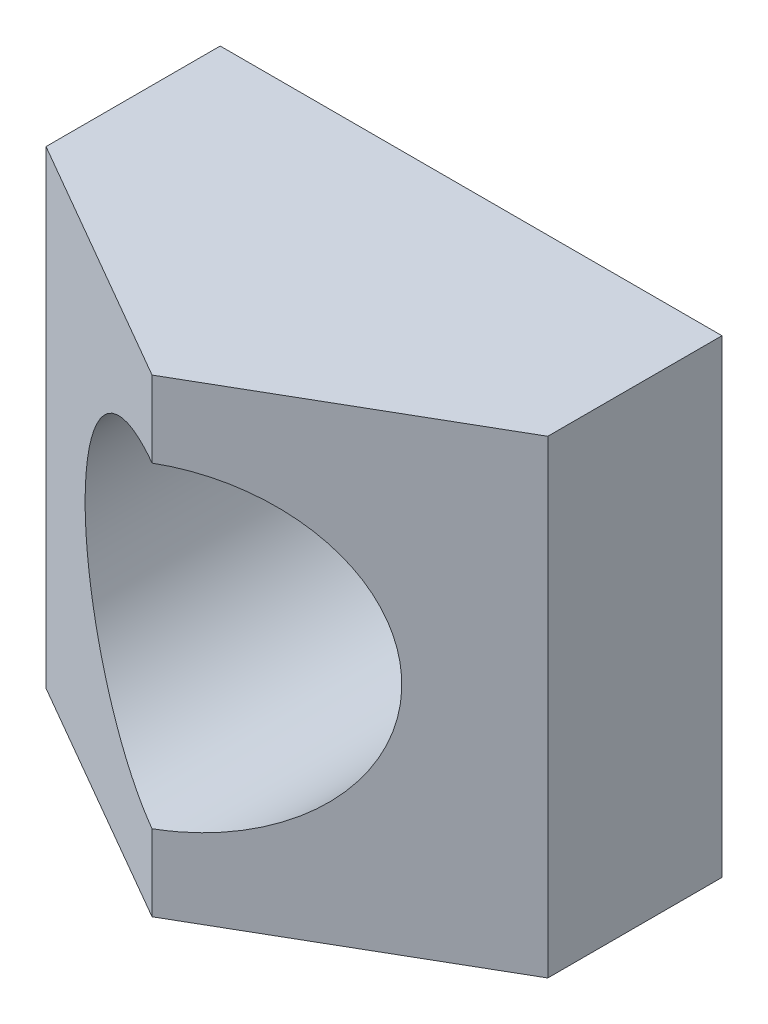
ISO-10303-21;
HEADER;
FILE_DESCRIPTION(('STEP AP214'),'2;1');
FILE_NAME('part.step','',(''),(''),'','','');
FILE_SCHEMA(('AUTOMOTIVE_DESIGN { 1 0 10303 214 1 1 1 1 }'));
ENDSEC;
DATA;
#1=APPLICATION_CONTEXT('core data for automotive mechanical design processes');
#2=APPLICATION_PROTOCOL_DEFINITION('international standard','automotive_design',2000,#1);
#3=PRODUCT_CONTEXT('',#1,'mechanical');
#4=PRODUCT('Part','Part','',(#3));
#5=PRODUCT_RELATED_PRODUCT_CATEGORY('part','',(#4));
#6=PRODUCT_DEFINITION_FORMATION('','',#4);
#7=PRODUCT_DEFINITION_CONTEXT('part definition',#1,'design');
#8=PRODUCT_DEFINITION('design','',#6,#7);
#9=PRODUCT_DEFINITION_SHAPE('','',#8);
#10=(LENGTH_UNIT() NAMED_UNIT(*) SI_UNIT(.MILLI.,.METRE.));
#11=(NAMED_UNIT(*) PLANE_ANGLE_UNIT() SI_UNIT($,.RADIAN.));
#12=(NAMED_UNIT(*) SI_UNIT($,.STERADIAN.) SOLID_ANGLE_UNIT());
#13=UNCERTAINTY_MEASURE_WITH_UNIT(LENGTH_MEASURE(1.E-05),#10,'distance_accuracy_value','');
#14=(GEOMETRIC_REPRESENTATION_CONTEXT(3) GLOBAL_UNCERTAINTY_ASSIGNED_CONTEXT((#13)) GLOBAL_UNIT_ASSIGNED_CONTEXT((#10,
#11,#12)) REPRESENTATION_CONTEXT('',''));
#15=CARTESIAN_POINT('',(0.,0.,0.));
#16=DIRECTION('',(0.,0.,1.));
#17=DIRECTION('',(1.,0.,0.));
#18=AXIS2_PLACEMENT_3D('',#15,#16,#17);
#19=CARTESIAN_POINT('',(0.,4.,4.94));
#20=DIRECTION('',(-0.5,0.,-0.866025403784439));
#21=DIRECTION('',(-0.866025403784439,0.,0.5));
#22=AXIS2_PLACEMENT_3D('',#19,#20,#21);
#23=PLANE('',#22);
#24=CARTESIAN_POINT('',(0.,0.,4.94));
#25=DIRECTION('',(-0.5,0.,-0.866025403784439));
#26=DIRECTION('',(0.866025403784439,0.,-0.5));
#27=AXIS2_PLACEMENT_3D('',#24,#25,#26);
#28=ELLIPSE('',#27,3.11769145362398,2.7);
#29=CARTESIAN_POINT('',(0.,-2.7,4.94));
#30=VERTEX_POINT('',#29);
#31=CARTESIAN_POINT('',(0.,2.7,4.94));
#32=VERTEX_POINT('',#31);
#33=EDGE_CURVE('E48',#30,#32,#28,.F.);
#34=ORIENTED_EDGE('',*,*,#33,.F.);
#35=DIRECTION('',(0.,-1.,0.));
#36=VECTOR('',#35,1.);
#37=CARTESIAN_POINT('',(0.,4.,4.94));
#38=LINE('',#37,#36);
#39=CARTESIAN_POINT('',(0.,-4.,4.94));
#40=VERTEX_POINT('',#39);
#41=EDGE_CURVE('E91',#30,#40,#38,.T.);
#42=ORIENTED_EDGE('',*,*,#41,.T.);
#43=DIRECTION('',(0.866025403784439,0.,-0.5));
#44=VECTOR('',#43,1.);
#45=CARTESIAN_POINT('',(0.,-4.,4.94));
#46=LINE('',#45,#44);
#47=CARTESIAN_POINT('',(4.27816549469512,-4.,2.47));
#48=VERTEX_POINT('',#47);
#49=EDGE_CURVE('E125',#40,#48,#46,.T.);
#50=ORIENTED_EDGE('',*,*,#49,.T.);
#51=DIRECTION('',(0.,-1.,0.));
#52=VECTOR('',#51,1.);
#53=CARTESIAN_POINT('',(4.27816549469512,4.,2.47));
#54=LINE('',#53,#52);
#55=CARTESIAN_POINT('',(4.27816549469512,4.,2.47));
#56=VERTEX_POINT('',#55);
#57=EDGE_CURVE('E112',#56,#48,#54,.T.);
#58=ORIENTED_EDGE('',*,*,#57,.F.);
#59=DIRECTION('',(0.866025403784439,0.,-0.5));
#60=VECTOR('',#59,1.);
#61=CARTESIAN_POINT('',(0.,4.,4.94));
#62=LINE('',#61,#60);
#63=CARTESIAN_POINT('',(0.,4.,4.94));
#64=VERTEX_POINT('',#63);
#65=EDGE_CURVE('E133',#64,#56,#62,.T.);
#66=ORIENTED_EDGE('',*,*,#65,.F.);
#67=EDGE_CURVE('E94',#64,#32,#38,.T.);
#68=ORIENTED_EDGE('',*,*,#67,.T.);
#69=EDGE_LOOP('',(#34,#42,#50,#58,#66,#68));
#70=FACE_BOUND('',#69,.T.);
#71=ADVANCED_FACE('F36',(#70),#23,.F.);
#72=CARTESIAN_POINT('',(-4.27816549469513,4.,2.47));
#73=DIRECTION('',(0.5,0.,-0.866025403784439));
#74=DIRECTION('',(-0.866025403784439,0.,-0.5));
#75=AXIS2_PLACEMENT_3D('',#72,#73,#74);
#76=PLANE('',#75);
#77=CARTESIAN_POINT('',(0.,0.,4.94));
#78=DIRECTION('',(0.5,0.,-0.866025403784439));
#79=DIRECTION('',(-0.866025403784439,0.,-0.5));
#80=AXIS2_PLACEMENT_3D('',#77,#78,#79);
#81=ELLIPSE('',#80,3.11769145362398,2.7);
#82=EDGE_CURVE('E12',#32,#30,#81,.F.);
#83=ORIENTED_EDGE('',*,*,#82,.F.);
#84=ORIENTED_EDGE('',*,*,#67,.F.);
#85=DIRECTION('',(0.866025403784439,0.,0.5));
#86=VECTOR('',#85,1.);
#87=CARTESIAN_POINT('',(-4.27816549469513,4.,2.47));
#88=LINE('',#87,#86);
#89=CARTESIAN_POINT('',(-4.27816549469513,4.,2.47));
#90=VERTEX_POINT('',#89);
#91=EDGE_CURVE('E103',#90,#64,#88,.T.);
#92=ORIENTED_EDGE('',*,*,#91,.F.);
#93=DIRECTION('',(0.,-1.,0.));
#94=VECTOR('',#93,1.);
#95=CARTESIAN_POINT('',(-4.27816549469513,4.,2.47));
#96=LINE('',#95,#94);
#97=CARTESIAN_POINT('',(-4.27816549469513,-4.,2.47));
#98=VERTEX_POINT('',#97);
#99=EDGE_CURVE('E105',#90,#98,#96,.T.);
#100=ORIENTED_EDGE('',*,*,#99,.T.);
#101=DIRECTION('',(0.866025403784439,0.,0.5));
#102=VECTOR('',#101,1.);
#103=CARTESIAN_POINT('',(-4.27816549469513,-4.,2.47));
#104=LINE('',#103,#102);
#105=EDGE_CURVE('E101',#98,#40,#104,.T.);
#106=ORIENTED_EDGE('',*,*,#105,.T.);
#107=ORIENTED_EDGE('',*,*,#41,.F.);
#108=EDGE_LOOP('',(#83,#84,#92,#100,#106,#107));
#109=FACE_BOUND('',#108,.T.);
#110=ADVANCED_FACE('F98',(#109),#76,.F.);
#111=CARTESIAN_POINT('',(0.,0.,-0.5));
#112=DIRECTION('',(0.,0.,1.));
#113=DIRECTION('',(1.,0.,0.));
#114=AXIS2_PLACEMENT_3D('',#111,#112,#113);
#115=PLANE('',#114);
#116=CARTESIAN_POINT('',(0.,0.,-0.5));
#117=DIRECTION('',(0.,0.,1.));
#118=DIRECTION('',(1.,0.,0.));
#119=AXIS2_PLACEMENT_3D('',#116,#117,#118);
#120=CIRCLE('',#119,2.7);
#121=CARTESIAN_POINT('',(2.7,0.,-0.5));
#122=VERTEX_POINT('',#121);
#123=EDGE_CURVE('E96',#122,#122,#120,.T.);
#124=ORIENTED_EDGE('',*,*,#123,.T.);
#125=EDGE_LOOP('',(#124));
#126=FACE_BOUND('',#125,.T.);
#127=DIRECTION('',(0.,-1.,0.));
#128=VECTOR('',#127,1.);
#129=CARTESIAN_POINT('',(-4.27816549469513,4.,-0.5));
#130=LINE('',#129,#128);
#131=CARTESIAN_POINT('',(-4.27816549469513,4.,-0.5));
#132=VERTEX_POINT('',#131);
#133=CARTESIAN_POINT('',(-4.27816549469513,-4.,-0.5));
#134=VERTEX_POINT('',#133);
#135=EDGE_CURVE('E95',#132,#134,#130,.T.);
#136=ORIENTED_EDGE('',*,*,#135,.F.);
#137=DIRECTION('',(1.,0.,0.));
#138=VECTOR('',#137,1.);
#139=CARTESIAN_POINT('',(0.,4.,-0.5));
#140=LINE('',#139,#138);
#141=CARTESIAN_POINT('',(4.27816549469512,4.,-0.5));
#142=VERTEX_POINT('',#141);
#143=EDGE_CURVE('E127',#132,#142,#140,.T.);
#144=ORIENTED_EDGE('',*,*,#143,.T.);
#145=DIRECTION('',(0.,1.,0.));
#146=VECTOR('',#145,1.);
#147=CARTESIAN_POINT('',(4.27816549469512,4.,-0.5));
#148=LINE('',#147,#146);
#149=CARTESIAN_POINT('',(4.27816549469512,-4.,-0.5));
#150=VERTEX_POINT('',#149);
#151=EDGE_CURVE('E56',#150,#142,#148,.T.);
#152=ORIENTED_EDGE('',*,*,#151,.F.);
#153=DIRECTION('',(1.,0.,0.));
#154=VECTOR('',#153,1.);
#155=CARTESIAN_POINT('',(0.,-4.,-0.5));
#156=LINE('',#155,#154);
#157=EDGE_CURVE('E43',#134,#150,#156,.T.);
#158=ORIENTED_EDGE('',*,*,#157,.F.);
#159=EDGE_LOOP('',(#136,#144,#152,#158));
#160=FACE_BOUND('',#159,.T.);
#161=ADVANCED_FACE('F142',(#126,#160),#115,.F.);
#162=CARTESIAN_POINT('',(4.27816549469512,4.,2.47));
#163=DIRECTION('',(-1.,0.,0.));
#164=DIRECTION('',(0.,0.,1.));
#165=AXIS2_PLACEMENT_3D('',#162,#163,#164);
#166=PLANE('',#165);
#167=DIRECTION('',(0.,0.,-1.));
#168=VECTOR('',#167,1.);
#169=CARTESIAN_POINT('',(4.27816549469512,-4.,2.47));
#170=LINE('',#169,#168);
#171=EDGE_CURVE('E118',#48,#150,#170,.T.);
#172=ORIENTED_EDGE('',*,*,#171,.T.);
#173=ORIENTED_EDGE('',*,*,#151,.T.);
#174=DIRECTION('',(0.,0.,-1.));
#175=VECTOR('',#174,1.);
#176=CARTESIAN_POINT('',(4.27816549469512,4.,2.47));
#177=LINE('',#176,#175);
#178=EDGE_CURVE('E131',#56,#142,#177,.T.);
#179=ORIENTED_EDGE('',*,*,#178,.F.);
#180=ORIENTED_EDGE('',*,*,#57,.T.);
#181=EDGE_LOOP('',(#172,#173,#179,#180));
#182=FACE_BOUND('',#181,.T.);
#183=ADVANCED_FACE('F122',(#182),#166,.F.);
#184=CARTESIAN_POINT('',(-4.27816549469513,4.,-2.47));
#185=DIRECTION('',(1.,0.,0.));
#186=DIRECTION('',(0.,0.,-1.));
#187=AXIS2_PLACEMENT_3D('',#184,#185,#186);
#188=PLANE('',#187);
#189=DIRECTION('',(0.,0.,1.));
#190=VECTOR('',#189,1.);
#191=CARTESIAN_POINT('',(-4.27816549469513,4.,-2.47));
#192=LINE('',#191,#190);
#193=EDGE_CURVE('E106',#132,#90,#192,.T.);
#194=ORIENTED_EDGE('',*,*,#193,.F.);
#195=ORIENTED_EDGE('',*,*,#135,.T.);
#196=DIRECTION('',(0.,0.,1.));
#197=VECTOR('',#196,1.);
#198=CARTESIAN_POINT('',(-4.27816549469513,-4.,-2.47));
#199=LINE('',#198,#197);
#200=EDGE_CURVE('E119',#134,#98,#199,.T.);
#201=ORIENTED_EDGE('',*,*,#200,.T.);
#202=ORIENTED_EDGE('',*,*,#99,.F.);
#203=EDGE_LOOP('',(#194,#195,#201,#202));
#204=FACE_BOUND('',#203,.T.);
#205=ADVANCED_FACE('F162',(#204),#188,.F.);
#206=CARTESIAN_POINT('',(0.,4.,0.));
#207=DIRECTION('',(0.,1.,0.));
#208=DIRECTION('',(0.,0.,1.));
#209=AXIS2_PLACEMENT_3D('',#206,#207,#208);
#210=PLANE('',#209);
#211=ORIENTED_EDGE('',*,*,#143,.F.);
#212=ORIENTED_EDGE('',*,*,#193,.T.);
#213=ORIENTED_EDGE('',*,*,#91,.T.);
#214=ORIENTED_EDGE('',*,*,#65,.T.);
#215=ORIENTED_EDGE('',*,*,#178,.T.);
#216=EDGE_LOOP('',(#211,#212,#213,#214,#215));
#217=FACE_BOUND('',#216,.T.);
#218=ADVANCED_FACE('F149',(#217),#210,.T.);
#219=CARTESIAN_POINT('',(0.,-4.,0.));
#220=DIRECTION('',(0.,1.,0.));
#221=DIRECTION('',(0.,0.,1.));
#222=AXIS2_PLACEMENT_3D('',#219,#220,#221);
#223=PLANE('',#222);
#224=ORIENTED_EDGE('',*,*,#200,.F.);
#225=ORIENTED_EDGE('',*,*,#157,.T.);
#226=ORIENTED_EDGE('',*,*,#171,.F.);
#227=ORIENTED_EDGE('',*,*,#49,.F.);
#228=ORIENTED_EDGE('',*,*,#105,.F.);
#229=EDGE_LOOP('',(#224,#225,#226,#227,#228));
#230=FACE_BOUND('',#229,.T.);
#231=ADVANCED_FACE('F117',(#230),#223,.F.);
#232=CARTESIAN_POINT('',(0.,0.,4.94));
#233=DIRECTION('',(0.,0.,-1.));
#234=DIRECTION('',(-1.,0.,0.));
#235=AXIS2_PLACEMENT_3D('',#232,#233,#234);
#236=CYLINDRICAL_SURFACE('',#235,2.7);
#237=ORIENTED_EDGE('',*,*,#123,.F.);
#238=EDGE_LOOP('',(#237));
#239=FACE_BOUND('',#238,.T.);
#240=ORIENTED_EDGE('',*,*,#33,.T.);
#241=ORIENTED_EDGE('',*,*,#82,.T.);
#242=EDGE_LOOP('',(#240,#241));
#243=FACE_BOUND('',#242,.T.);
#244=ADVANCED_FACE('F84',(#239,#243),#236,.F.);
#245=CLOSED_SHELL('',(#71,#110,#161,#183,#205,#218,#231,#244));
#246=MANIFOLD_SOLID_BREP('B2',#245);
#247=ADVANCED_BREP_SHAPE_REPRESENTATION('',(#18,#246),#14);
#248=SHAPE_DEFINITION_REPRESENTATION(#9,#247);
ENDSEC;
END-ISO-10303-21;
